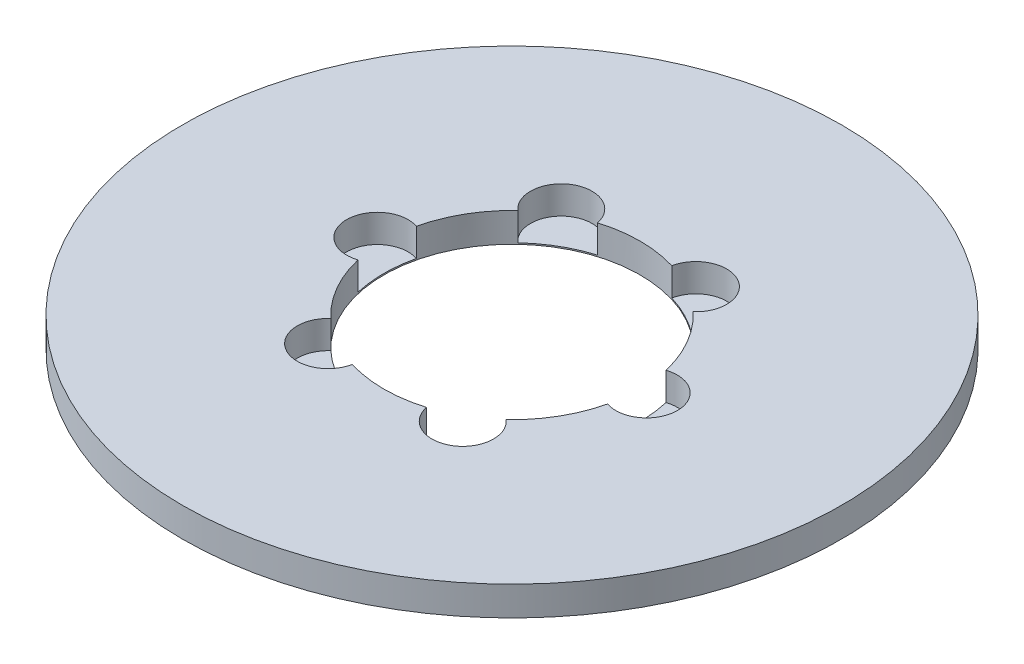
ISO-10303-21;
HEADER;
FILE_DESCRIPTION(('STEP AP214'),'2;1');
FILE_NAME('part.step','',(''),(''),'','','');
FILE_SCHEMA(('AUTOMOTIVE_DESIGN { 1 0 10303 214 1 1 1 1 }'));
ENDSEC;
DATA;
#1=APPLICATION_CONTEXT('core data for automotive mechanical design processes');
#2=APPLICATION_PROTOCOL_DEFINITION('international standard','automotive_design',2000,#1);
#3=PRODUCT_CONTEXT('',#1,'mechanical');
#4=PRODUCT('Part','Part','',(#3));
#5=PRODUCT_RELATED_PRODUCT_CATEGORY('part','',(#4));
#6=PRODUCT_DEFINITION_FORMATION('','',#4);
#7=PRODUCT_DEFINITION_CONTEXT('part definition',#1,'design');
#8=PRODUCT_DEFINITION('design','',#6,#7);
#9=PRODUCT_DEFINITION_SHAPE('','',#8);
#10=(LENGTH_UNIT() NAMED_UNIT(*) SI_UNIT(.MILLI.,.METRE.));
#11=(NAMED_UNIT(*) PLANE_ANGLE_UNIT() SI_UNIT($,.RADIAN.));
#12=(NAMED_UNIT(*) SI_UNIT($,.STERADIAN.) SOLID_ANGLE_UNIT());
#13=UNCERTAINTY_MEASURE_WITH_UNIT(LENGTH_MEASURE(1.E-05),#10,'distance_accuracy_value','');
#14=(GEOMETRIC_REPRESENTATION_CONTEXT(3) GLOBAL_UNCERTAINTY_ASSIGNED_CONTEXT((#13)) GLOBAL_UNIT_ASSIGNED_CONTEXT((#10,
#11,#12)) REPRESENTATION_CONTEXT('',''));
#15=CARTESIAN_POINT('',(0.,0.,0.));
#16=DIRECTION('',(0.,0.,1.));
#17=DIRECTION('',(1.,0.,0.));
#18=AXIS2_PLACEMENT_3D('',#15,#16,#17);
#19=CARTESIAN_POINT('',(0.,4.,0.));
#20=DIRECTION('',(0.,-1.,0.));
#21=DIRECTION('',(0.,0.,-1.));
#22=AXIS2_PLACEMENT_3D('',#19,#20,#21);
#23=CYLINDRICAL_SURFACE('',#22,45.);
#24=CARTESIAN_POINT('',(0.,4.,0.));
#25=DIRECTION('',(0.,1.,0.));
#26=DIRECTION('',(0.,0.,1.));
#27=AXIS2_PLACEMENT_3D('',#24,#25,#26);
#28=CIRCLE('',#27,45.);
#29=CARTESIAN_POINT('',(0.,4.,45.));
#30=VERTEX_POINT('',#29);
#31=EDGE_CURVE('E171',#30,#30,#28,.T.);
#32=ORIENTED_EDGE('',*,*,#31,.F.);
#33=EDGE_LOOP('',(#32));
#34=FACE_BOUND('',#33,.T.);
#35=CARTESIAN_POINT('',(0.,0.,0.));
#36=DIRECTION('',(0.,1.,0.));
#37=DIRECTION('',(0.,0.,1.));
#38=AXIS2_PLACEMENT_3D('',#35,#36,#37);
#39=CIRCLE('',#38,45.);
#40=CARTESIAN_POINT('',(0.,0.,45.));
#41=VERTEX_POINT('',#40);
#42=EDGE_CURVE('E157',#41,#41,#39,.T.);
#43=ORIENTED_EDGE('',*,*,#42,.T.);
#44=EDGE_LOOP('',(#43));
#45=FACE_BOUND('',#44,.T.);
#46=ADVANCED_FACE('F39',(#34,#45),#23,.T.);
#47=CARTESIAN_POINT('',(0.,4.,0.));
#48=DIRECTION('',(0.,1.,0.));
#49=DIRECTION('',(0.,0.,1.));
#50=AXIS2_PLACEMENT_3D('',#47,#48,#49);
#51=PLANE('',#50);
#52=CARTESIAN_POINT('',(-9.19053370062146,4.,-15.91847131815));
#53=DIRECTION('',(0.,1.,0.));
#54=DIRECTION('',(-0.866025403784433,0.,0.50000000000001));
#55=AXIS2_PLACEMENT_3D('',#52,#53,#54);
#56=CIRCLE('',#55,4.20195601796517);
#57=CARTESIAN_POINT('',(-5.07148010688413,4.,-16.7490324952064));
#58=VERTEX_POINT('',#57);
#59=CARTESIAN_POINT('',(-11.969347576218,4.,-12.766546854952));
#60=VERTEX_POINT('',#59);
#61=EDGE_CURVE('E214',#58,#60,#56,.T.);
#62=ORIENTED_EDGE('',*,*,#61,.F.);
#63=CARTESIAN_POINT('',(0.,4.,0.));
#64=DIRECTION('',(0.,1.,0.));
#65=DIRECTION('',(0.,0.,1.));
#66=AXIS2_PLACEMENT_3D('',#63,#64,#65);
#67=CIRCLE('',#66,17.5);
#68=CARTESIAN_POINT('',(5.07148010688378,4.,-16.7490324952065));
#69=VERTEX_POINT('',#68);
#70=EDGE_CURVE('E272',#69,#58,#67,.T.);
#71=ORIENTED_EDGE('',*,*,#70,.F.);
#72=CARTESIAN_POINT('',(9.19053370062112,4.,-15.9184713181501));
#73=DIRECTION('',(0.,1.,0.));
#74=DIRECTION('',(-0.866025403784443,0.,-0.499999999999992));
#75=AXIS2_PLACEMENT_3D('',#72,#73,#74);
#76=CIRCLE('',#75,4.20195601796517);
#77=CARTESIAN_POINT('',(11.9693475762177,4.,-12.7665468549522));
#78=VERTEX_POINT('',#77);
#79=EDGE_CURVE('E285',#78,#69,#76,.T.);
#80=ORIENTED_EDGE('',*,*,#79,.F.);
#81=CARTESIAN_POINT('',(17.0408276831018,4.,-3.9824856402543));
#82=VERTEX_POINT('',#81);
#83=EDGE_CURVE('E165',#82,#78,#67,.T.);
#84=ORIENTED_EDGE('',*,*,#83,.F.);
#85=CARTESIAN_POINT('',(18.3810674012425,4.,0.));
#86=DIRECTION('',(0.,1.,0.));
#87=DIRECTION('',(0.,0.,-1.));
#88=AXIS2_PLACEMENT_3D('',#85,#86,#87);
#89=CIRCLE('',#88,4.20195601796517);
#90=CARTESIAN_POINT('',(17.0408276831018,4.,3.9824856402543));
#91=VERTEX_POINT('',#90);
#92=EDGE_CURVE('E281',#91,#82,#89,.T.);
#93=ORIENTED_EDGE('',*,*,#92,.F.);
#94=CARTESIAN_POINT('',(11.9693475762179,4.,12.7665468549521));
#95=VERTEX_POINT('',#94);
#96=EDGE_CURVE('E160',#95,#91,#67,.T.);
#97=ORIENTED_EDGE('',*,*,#96,.F.);
#98=CARTESIAN_POINT('',(9.19053370062135,4.,15.91847131815));
#99=DIRECTION('',(0.,1.,0.));
#100=DIRECTION('',(0.866025403784436,0.,-0.500000000000004));
#101=AXIS2_PLACEMENT_3D('',#98,#99,#100);
#102=CIRCLE('',#101,4.20195601796517);
#103=CARTESIAN_POINT('',(5.07148010688402,4.,16.7490324952064));
#104=VERTEX_POINT('',#103);
#105=EDGE_CURVE('E154',#104,#95,#102,.T.);
#106=ORIENTED_EDGE('',*,*,#105,.F.);
#107=CARTESIAN_POINT('',(-5.0714801068839,4.,16.7490324952064));
#108=VERTEX_POINT('',#107);
#109=EDGE_CURVE('E150',#108,#104,#67,.T.);
#110=ORIENTED_EDGE('',*,*,#109,.F.);
#111=CARTESIAN_POINT('',(-9.19053370062124,4.,15.9184713181501));
#112=DIRECTION('',(0.,1.,0.));
#113=DIRECTION('',(0.86602540378444,0.,0.499999999999998));
#114=AXIS2_PLACEMENT_3D('',#111,#112,#113);
#115=CIRCLE('',#114,4.20195601796517);
#116=CARTESIAN_POINT('',(-11.9693475762178,4.,12.7665468549522));
#117=VERTEX_POINT('',#116);
#118=EDGE_CURVE('E127',#117,#108,#115,.T.);
#119=ORIENTED_EDGE('',*,*,#118,.F.);
#120=CARTESIAN_POINT('',(-17.0408276831018,4.,3.9824856402543));
#121=VERTEX_POINT('',#120);
#122=EDGE_CURVE('E156',#121,#117,#67,.T.);
#123=ORIENTED_EDGE('',*,*,#122,.F.);
#124=CARTESIAN_POINT('',(-18.3810674012425,4.,0.));
#125=DIRECTION('',(0.,1.,0.));
#126=DIRECTION('',(0.,0.,1.));
#127=AXIS2_PLACEMENT_3D('',#124,#125,#126);
#128=CIRCLE('',#127,4.20195601796517);
#129=CARTESIAN_POINT('',(-17.0408276831018,4.,-3.9824856402543));
#130=VERTEX_POINT('',#129);
#131=EDGE_CURVE('E164',#130,#121,#128,.T.);
#132=ORIENTED_EDGE('',*,*,#131,.F.);
#133=EDGE_CURVE('E159',#60,#130,#67,.T.);
#134=ORIENTED_EDGE('',*,*,#133,.F.);
#135=EDGE_LOOP('',(#62,#71,#80,#84,#93,#97,#106,#110,#119,#123,#132,#134));
#136=FACE_BOUND('',#135,.T.);
#137=ORIENTED_EDGE('',*,*,#31,.T.);
#138=EDGE_LOOP('',(#137));
#139=FACE_BOUND('',#138,.T.);
#140=ADVANCED_FACE('F155',(#136,#139),#51,.T.);
#141=CARTESIAN_POINT('',(0.,0.,0.));
#142=DIRECTION('',(0.,1.,0.));
#143=DIRECTION('',(0.,0.,1.));
#144=AXIS2_PLACEMENT_3D('',#141,#142,#143);
#145=PLANE('',#144);
#146=CARTESIAN_POINT('',(0.,0.,0.));
#147=DIRECTION('',(0.,1.,0.));
#148=DIRECTION('',(0.,0.,1.));
#149=AXIS2_PLACEMENT_3D('',#146,#147,#148);
#150=CIRCLE('',#149,17.5);
#151=CARTESIAN_POINT('',(0.,0.,17.5));
#152=VERTEX_POINT('',#151);
#153=EDGE_CURVE('E170',#152,#152,#150,.T.);
#154=ORIENTED_EDGE('',*,*,#153,.T.);
#155=EDGE_LOOP('',(#154));
#156=FACE_BOUND('',#155,.T.);
#157=ORIENTED_EDGE('',*,*,#42,.F.);
#158=EDGE_LOOP('',(#157));
#159=FACE_BOUND('',#158,.T.);
#160=ADVANCED_FACE('F232',(#156,#159),#145,.F.);
#161=CARTESIAN_POINT('',(0.,4.,0.));
#162=DIRECTION('',(0.,-1.,0.));
#163=DIRECTION('',(0.,0.,-1.));
#164=AXIS2_PLACEMENT_3D('',#161,#162,#163);
#165=CYLINDRICAL_SURFACE('',#164,17.5);
#166=DIRECTION('',(0.,1.,0.));
#167=VECTOR('',#166,1.);
#168=CARTESIAN_POINT('',(-5.07148010688413,2.09087289287385,-16.7490324952064));
#169=LINE('',#168,#167);
#170=CARTESIAN_POINT('',(-5.07148010688413,0.181745785747694,-16.7490324952064));
#171=VERTEX_POINT('',#170);
#172=EDGE_CURVE('E11',#171,#58,#169,.T.);
#173=ORIENTED_EDGE('',*,*,#172,.F.);
#174=CARTESIAN_POINT('',(0.,0.181745785747694,0.));
#175=DIRECTION('',(0.,1.,0.));
#176=DIRECTION('',(0.,0.,1.));
#177=AXIS2_PLACEMENT_3D('',#174,#175,#176);
#178=CIRCLE('',#177,17.5);
#179=CARTESIAN_POINT('',(-11.969347576218,0.181745785747694,-12.766546854952));
#180=VERTEX_POINT('',#179);
#181=EDGE_CURVE('E209',#171,#180,#178,.T.);
#182=ORIENTED_EDGE('',*,*,#181,.T.);
#183=DIRECTION('',(0.,1.,0.));
#184=VECTOR('',#183,1.);
#185=CARTESIAN_POINT('',(-11.969347576218,2.09087289287385,-12.766546854952));
#186=LINE('',#185,#184);
#187=EDGE_CURVE('E46',#60,#180,#186,.F.);
#188=ORIENTED_EDGE('',*,*,#187,.F.);
#189=ORIENTED_EDGE('',*,*,#133,.T.);
#190=DIRECTION('',(0.,1.,0.));
#191=VECTOR('',#190,1.);
#192=CARTESIAN_POINT('',(-17.0408276831018,2.09087289287385,-3.9824856402543));
#193=LINE('',#192,#191);
#194=CARTESIAN_POINT('',(-17.0408276831018,0.181745785747694,-3.9824856402543));
#195=VERTEX_POINT('',#194);
#196=EDGE_CURVE('E185',#195,#130,#193,.T.);
#197=ORIENTED_EDGE('',*,*,#196,.F.);
#198=CARTESIAN_POINT('',(0.,0.181745785747694,0.));
#199=DIRECTION('',(0.,1.,0.));
#200=DIRECTION('',(0.,0.,1.));
#201=AXIS2_PLACEMENT_3D('',#198,#199,#200);
#202=CIRCLE('',#201,17.5);
#203=CARTESIAN_POINT('',(-17.0408276831018,0.181745785747694,3.9824856402543));
#204=VERTEX_POINT('',#203);
#205=EDGE_CURVE('E173',#195,#204,#202,.T.);
#206=ORIENTED_EDGE('',*,*,#205,.T.);
#207=DIRECTION('',(0.,1.,0.));
#208=VECTOR('',#207,1.);
#209=CARTESIAN_POINT('',(-17.0408276831018,2.09087289287385,3.9824856402543));
#210=LINE('',#209,#208);
#211=EDGE_CURVE('E178',#121,#204,#210,.F.);
#212=ORIENTED_EDGE('',*,*,#211,.F.);
#213=ORIENTED_EDGE('',*,*,#122,.T.);
#214=DIRECTION('',(0.,1.,0.));
#215=VECTOR('',#214,1.);
#216=CARTESIAN_POINT('',(-11.9693475762178,2.09087289287385,12.7665468549522));
#217=LINE('',#216,#215);
#218=CARTESIAN_POINT('',(-11.9693475762178,0.181745785747694,12.7665468549522));
#219=VERTEX_POINT('',#218);
#220=EDGE_CURVE('E132',#219,#117,#217,.T.);
#221=ORIENTED_EDGE('',*,*,#220,.F.);
#222=CARTESIAN_POINT('',(0.,0.181745785747694,0.));
#223=DIRECTION('',(0.,1.,0.));
#224=DIRECTION('',(0.,0.,1.));
#225=AXIS2_PLACEMENT_3D('',#222,#223,#224);
#226=CIRCLE('',#225,17.5);
#227=CARTESIAN_POINT('',(-5.0714801068839,0.181745785747694,16.7490324952064));
#228=VERTEX_POINT('',#227);
#229=EDGE_CURVE('E146',#219,#228,#226,.T.);
#230=ORIENTED_EDGE('',*,*,#229,.T.);
#231=DIRECTION('',(0.,1.,0.));
#232=VECTOR('',#231,1.);
#233=CARTESIAN_POINT('',(-5.0714801068839,2.09087289287385,16.7490324952064));
#234=LINE('',#233,#232);
#235=EDGE_CURVE('E128',#108,#228,#234,.F.);
#236=ORIENTED_EDGE('',*,*,#235,.F.);
#237=ORIENTED_EDGE('',*,*,#109,.T.);
#238=DIRECTION('',(0.,1.,0.));
#239=VECTOR('',#238,1.);
#240=CARTESIAN_POINT('',(5.07148010688402,2.09087289287385,16.7490324952064));
#241=LINE('',#240,#239);
#242=CARTESIAN_POINT('',(5.07148010688402,0.181745785747694,16.7490324952064));
#243=VERTEX_POINT('',#242);
#244=EDGE_CURVE('E192',#243,#104,#241,.T.);
#245=ORIENTED_EDGE('',*,*,#244,.F.);
#246=CARTESIAN_POINT('',(0.,0.181745785747694,0.));
#247=DIRECTION('',(0.,1.,0.));
#248=DIRECTION('',(0.,0.,1.));
#249=AXIS2_PLACEMENT_3D('',#246,#247,#248);
#250=CIRCLE('',#249,17.5);
#251=CARTESIAN_POINT('',(11.9693475762179,0.181745785747694,12.7665468549521));
#252=VERTEX_POINT('',#251);
#253=EDGE_CURVE('E190',#243,#252,#250,.T.);
#254=ORIENTED_EDGE('',*,*,#253,.T.);
#255=DIRECTION('',(0.,1.,0.));
#256=VECTOR('',#255,1.);
#257=CARTESIAN_POINT('',(11.9693475762179,2.09087289287385,12.7665468549521));
#258=LINE('',#257,#256);
#259=EDGE_CURVE('E189',#95,#252,#258,.F.);
#260=ORIENTED_EDGE('',*,*,#259,.F.);
#261=ORIENTED_EDGE('',*,*,#96,.T.);
#262=DIRECTION('',(0.,1.,0.));
#263=VECTOR('',#262,1.);
#264=CARTESIAN_POINT('',(17.0408276831018,2.09087289287385,3.9824856402543));
#265=LINE('',#264,#263);
#266=CARTESIAN_POINT('',(17.0408276831018,0.181745785747694,3.9824856402543));
#267=VERTEX_POINT('',#266);
#268=EDGE_CURVE('E203',#267,#91,#265,.T.);
#269=ORIENTED_EDGE('',*,*,#268,.F.);
#270=CARTESIAN_POINT('',(0.,0.181745785747694,0.));
#271=DIRECTION('',(0.,1.,0.));
#272=DIRECTION('',(0.,0.,1.));
#273=AXIS2_PLACEMENT_3D('',#270,#271,#272);
#274=CIRCLE('',#273,17.5);
#275=CARTESIAN_POINT('',(17.0408276831018,0.181745785747694,-3.9824856402543));
#276=VERTEX_POINT('',#275);
#277=EDGE_CURVE('E194',#267,#276,#274,.T.);
#278=ORIENTED_EDGE('',*,*,#277,.T.);
#279=DIRECTION('',(0.,1.,0.));
#280=VECTOR('',#279,1.);
#281=CARTESIAN_POINT('',(17.0408276831018,2.09087289287385,-3.9824856402543));
#282=LINE('',#281,#280);
#283=EDGE_CURVE('E196',#82,#276,#282,.F.);
#284=ORIENTED_EDGE('',*,*,#283,.F.);
#285=ORIENTED_EDGE('',*,*,#83,.T.);
#286=DIRECTION('',(0.,1.,0.));
#287=VECTOR('',#286,1.);
#288=CARTESIAN_POINT('',(11.9693475762177,2.09087289287385,-12.7665468549522));
#289=LINE('',#288,#287);
#290=CARTESIAN_POINT('',(11.9693475762177,0.181745785747694,-12.7665468549522));
#291=VERTEX_POINT('',#290);
#292=EDGE_CURVE('E208',#291,#78,#289,.T.);
#293=ORIENTED_EDGE('',*,*,#292,.F.);
#294=CARTESIAN_POINT('',(0.,0.181745785747694,0.));
#295=DIRECTION('',(0.,1.,0.));
#296=DIRECTION('',(0.,0.,1.));
#297=AXIS2_PLACEMENT_3D('',#294,#295,#296);
#298=CIRCLE('',#297,17.5);
#299=CARTESIAN_POINT('',(5.07148010688378,0.181745785747694,-16.7490324952065));
#300=VERTEX_POINT('',#299);
#301=EDGE_CURVE('E201',#291,#300,#298,.T.);
#302=ORIENTED_EDGE('',*,*,#301,.T.);
#303=DIRECTION('',(0.,1.,0.));
#304=VECTOR('',#303,1.);
#305=CARTESIAN_POINT('',(5.07148010688378,2.09087289287385,-16.7490324952065));
#306=LINE('',#305,#304);
#307=EDGE_CURVE('E206',#69,#300,#306,.F.);
#308=ORIENTED_EDGE('',*,*,#307,.F.);
#309=ORIENTED_EDGE('',*,*,#70,.T.);
#310=EDGE_LOOP('',(#173,#182,#188,#189,#197,#206,#212,#213,#221,#230,#236,#237,#245,#254,#260,
#261,#269,#278,#284,#285,#293,#302,#308,#309));
#311=FACE_BOUND('',#310,.T.);
#312=ORIENTED_EDGE('',*,*,#153,.F.);
#313=EDGE_LOOP('',(#312));
#314=FACE_BOUND('',#313,.T.);
#315=ADVANCED_FACE('F145',(#311,#314),#165,.F.);
#316=CARTESIAN_POINT('',(-18.3810674012425,0.181745785747694,0.));
#317=DIRECTION('',(0.,1.,0.));
#318=DIRECTION('',(0.,0.,1.));
#319=AXIS2_PLACEMENT_3D('',#316,#317,#318);
#320=CYLINDRICAL_SURFACE('',#319,4.20195601796517);
#321=ORIENTED_EDGE('',*,*,#196,.T.);
#322=ORIENTED_EDGE('',*,*,#131,.T.);
#323=ORIENTED_EDGE('',*,*,#211,.T.);
#324=CARTESIAN_POINT('',(-18.3810674012425,0.181745785747694,0.));
#325=DIRECTION('',(0.,1.,0.));
#326=DIRECTION('',(0.,0.,1.));
#327=AXIS2_PLACEMENT_3D('',#324,#325,#326);
#328=CIRCLE('',#327,4.20195601796517);
#329=EDGE_CURVE('E168',#195,#204,#328,.T.);
#330=ORIENTED_EDGE('',*,*,#329,.F.);
#331=EDGE_LOOP('',(#321,#322,#323,#330));
#332=FACE_BOUND('',#331,.T.);
#333=ADVANCED_FACE('F243',(#332),#320,.F.);
#334=CARTESIAN_POINT('',(-18.3810674012425,0.181745785747694,0.));
#335=DIRECTION('',(0.,1.,0.));
#336=DIRECTION('',(0.,0.,1.));
#337=AXIS2_PLACEMENT_3D('',#334,#335,#336);
#338=PLANE('',#337);
#339=ORIENTED_EDGE('',*,*,#329,.T.);
#340=ORIENTED_EDGE('',*,*,#205,.F.);
#341=EDGE_LOOP('',(#339,#340));
#342=FACE_BOUND('',#341,.T.);
#343=ADVANCED_FACE('F247',(#342),#338,.T.);
#344=CARTESIAN_POINT('',(-9.19053370062124,0.181745785747694,15.9184713181501));
#345=DIRECTION('',(0.,1.,0.));
#346=DIRECTION('',(0.,0.,1.));
#347=AXIS2_PLACEMENT_3D('',#344,#345,#346);
#348=CYLINDRICAL_SURFACE('',#347,4.20195601796517);
#349=ORIENTED_EDGE('',*,*,#220,.T.);
#350=ORIENTED_EDGE('',*,*,#118,.T.);
#351=ORIENTED_EDGE('',*,*,#235,.T.);
#352=CARTESIAN_POINT('',(-9.19053370062124,0.181745785747694,15.9184713181501));
#353=DIRECTION('',(0.,1.,0.));
#354=DIRECTION('',(0.86602540378444,0.,0.499999999999998));
#355=AXIS2_PLACEMENT_3D('',#352,#353,#354);
#356=CIRCLE('',#355,4.20195601796517);
#357=EDGE_CURVE('E137',#219,#228,#356,.T.);
#358=ORIENTED_EDGE('',*,*,#357,.F.);
#359=EDGE_LOOP('',(#349,#350,#351,#358));
#360=FACE_BOUND('',#359,.T.);
#361=ADVANCED_FACE('F126',(#360),#348,.F.);
#362=CARTESIAN_POINT('',(-9.19053370062124,0.181745785747694,15.9184713181501));
#363=DIRECTION('',(0.,1.,0.));
#364=DIRECTION('',(0.86602540378444,0.,0.499999999999998));
#365=AXIS2_PLACEMENT_3D('',#362,#363,#364);
#366=PLANE('',#365);
#367=ORIENTED_EDGE('',*,*,#357,.T.);
#368=ORIENTED_EDGE('',*,*,#229,.F.);
#369=EDGE_LOOP('',(#367,#368));
#370=FACE_BOUND('',#369,.T.);
#371=ADVANCED_FACE('F254',(#370),#366,.T.);
#372=CARTESIAN_POINT('',(9.19053370062135,0.181745785747694,15.91847131815));
#373=DIRECTION('',(0.,1.,0.));
#374=DIRECTION('',(0.,0.,1.));
#375=AXIS2_PLACEMENT_3D('',#372,#373,#374);
#376=CYLINDRICAL_SURFACE('',#375,4.20195601796517);
#377=ORIENTED_EDGE('',*,*,#244,.T.);
#378=ORIENTED_EDGE('',*,*,#105,.T.);
#379=ORIENTED_EDGE('',*,*,#259,.T.);
#380=CARTESIAN_POINT('',(9.19053370062135,0.181745785747694,15.91847131815));
#381=DIRECTION('',(0.,1.,0.));
#382=DIRECTION('',(0.866025403784436,0.,-0.500000000000004));
#383=AXIS2_PLACEMENT_3D('',#380,#381,#382);
#384=CIRCLE('',#383,4.20195601796517);
#385=EDGE_CURVE('E138',#243,#252,#384,.T.);
#386=ORIENTED_EDGE('',*,*,#385,.F.);
#387=EDGE_LOOP('',(#377,#378,#379,#386));
#388=FACE_BOUND('',#387,.T.);
#389=ADVANCED_FACE('F260',(#388),#376,.F.);
#390=CARTESIAN_POINT('',(9.19053370062135,0.181745785747694,15.91847131815));
#391=DIRECTION('',(0.,1.,0.));
#392=DIRECTION('',(0.866025403784436,0.,-0.500000000000004));
#393=AXIS2_PLACEMENT_3D('',#390,#391,#392);
#394=PLANE('',#393);
#395=ORIENTED_EDGE('',*,*,#385,.T.);
#396=ORIENTED_EDGE('',*,*,#253,.F.);
#397=EDGE_LOOP('',(#395,#396));
#398=FACE_BOUND('',#397,.T.);
#399=ADVANCED_FACE('F265',(#398),#394,.T.);
#400=CARTESIAN_POINT('',(18.3810674012425,0.181745785747694,0.));
#401=DIRECTION('',(0.,1.,0.));
#402=DIRECTION('',(0.,0.,1.));
#403=AXIS2_PLACEMENT_3D('',#400,#401,#402);
#404=CYLINDRICAL_SURFACE('',#403,4.20195601796517);
#405=ORIENTED_EDGE('',*,*,#268,.T.);
#406=ORIENTED_EDGE('',*,*,#92,.T.);
#407=ORIENTED_EDGE('',*,*,#283,.T.);
#408=CARTESIAN_POINT('',(18.3810674012425,0.181745785747694,0.));
#409=DIRECTION('',(0.,1.,0.));
#410=DIRECTION('',(0.,0.,-1.));
#411=AXIS2_PLACEMENT_3D('',#408,#409,#410);
#412=CIRCLE('',#411,4.20195601796517);
#413=EDGE_CURVE('E287',#267,#276,#412,.T.);
#414=ORIENTED_EDGE('',*,*,#413,.F.);
#415=EDGE_LOOP('',(#405,#406,#407,#414));
#416=FACE_BOUND('',#415,.T.);
#417=ADVANCED_FACE('F300',(#416),#404,.F.);
#418=CARTESIAN_POINT('',(18.3810674012425,0.181745785747694,0.));
#419=DIRECTION('',(0.,1.,0.));
#420=DIRECTION('',(0.,0.,-1.));
#421=AXIS2_PLACEMENT_3D('',#418,#419,#420);
#422=PLANE('',#421);
#423=ORIENTED_EDGE('',*,*,#413,.T.);
#424=ORIENTED_EDGE('',*,*,#277,.F.);
#425=EDGE_LOOP('',(#423,#424));
#426=FACE_BOUND('',#425,.T.);
#427=ADVANCED_FACE('F298',(#426),#422,.T.);
#428=CARTESIAN_POINT('',(9.19053370062112,0.181745785747694,-15.9184713181501));
#429=DIRECTION('',(0.,1.,0.));
#430=DIRECTION('',(0.,0.,1.));
#431=AXIS2_PLACEMENT_3D('',#428,#429,#430);
#432=CYLINDRICAL_SURFACE('',#431,4.20195601796517);
#433=ORIENTED_EDGE('',*,*,#292,.T.);
#434=ORIENTED_EDGE('',*,*,#79,.T.);
#435=ORIENTED_EDGE('',*,*,#307,.T.);
#436=CARTESIAN_POINT('',(9.19053370062112,0.181745785747694,-15.9184713181501));
#437=DIRECTION('',(0.,1.,0.));
#438=DIRECTION('',(-0.866025403784443,0.,-0.499999999999992));
#439=AXIS2_PLACEMENT_3D('',#436,#437,#438);
#440=CIRCLE('',#439,4.20195601796517);
#441=EDGE_CURVE('E56',#291,#300,#440,.T.);
#442=ORIENTED_EDGE('',*,*,#441,.F.);
#443=EDGE_LOOP('',(#433,#434,#435,#442));
#444=FACE_BOUND('',#443,.T.);
#445=ADVANCED_FACE('F301',(#444),#432,.F.);
#446=CARTESIAN_POINT('',(9.19053370062112,0.181745785747694,-15.9184713181501));
#447=DIRECTION('',(0.,1.,0.));
#448=DIRECTION('',(-0.866025403784443,0.,-0.499999999999992));
#449=AXIS2_PLACEMENT_3D('',#446,#447,#448);
#450=PLANE('',#449);
#451=ORIENTED_EDGE('',*,*,#441,.T.);
#452=ORIENTED_EDGE('',*,*,#301,.F.);
#453=EDGE_LOOP('',(#451,#452));
#454=FACE_BOUND('',#453,.T.);
#455=ADVANCED_FACE('F221',(#454),#450,.T.);
#456=CARTESIAN_POINT('',(-9.19053370062146,0.181745785747694,-15.91847131815));
#457=DIRECTION('',(0.,1.,0.));
#458=DIRECTION('',(0.,0.,1.));
#459=AXIS2_PLACEMENT_3D('',#456,#457,#458);
#460=CYLINDRICAL_SURFACE('',#459,4.20195601796517);
#461=ORIENTED_EDGE('',*,*,#172,.T.);
#462=ORIENTED_EDGE('',*,*,#61,.T.);
#463=ORIENTED_EDGE('',*,*,#187,.T.);
#464=CARTESIAN_POINT('',(-9.19053370062146,0.181745785747694,-15.91847131815));
#465=DIRECTION('',(0.,1.,0.));
#466=DIRECTION('',(-0.866025403784433,0.,0.50000000000001));
#467=AXIS2_PLACEMENT_3D('',#464,#465,#466);
#468=CIRCLE('',#467,4.20195601796517);
#469=EDGE_CURVE('E55',#171,#180,#468,.T.);
#470=ORIENTED_EDGE('',*,*,#469,.F.);
#471=EDGE_LOOP('',(#461,#462,#463,#470));
#472=FACE_BOUND('',#471,.T.);
#473=ADVANCED_FACE('F212',(#472),#460,.F.);
#474=CARTESIAN_POINT('',(-9.19053370062146,0.181745785747694,-15.91847131815));
#475=DIRECTION('',(0.,1.,0.));
#476=DIRECTION('',(-0.866025403784433,0.,0.50000000000001));
#477=AXIS2_PLACEMENT_3D('',#474,#475,#476);
#478=PLANE('',#477);
#479=ORIENTED_EDGE('',*,*,#469,.T.);
#480=ORIENTED_EDGE('',*,*,#181,.F.);
#481=EDGE_LOOP('',(#479,#480));
#482=FACE_BOUND('',#481,.T.);
#483=ADVANCED_FACE('F217',(#482),#478,.T.);
#484=CLOSED_SHELL('',(#46,#140,#160,#315,#333,#343,#361,#371,#389,#399,#417,#427,#445,#455,#473,#483));
#485=MANIFOLD_SOLID_BREP('B2',#484);
#486=ADVANCED_BREP_SHAPE_REPRESENTATION('',(#18,#485),#14);
#487=SHAPE_DEFINITION_REPRESENTATION(#9,#486);
ENDSEC;
END-ISO-10303-21;
